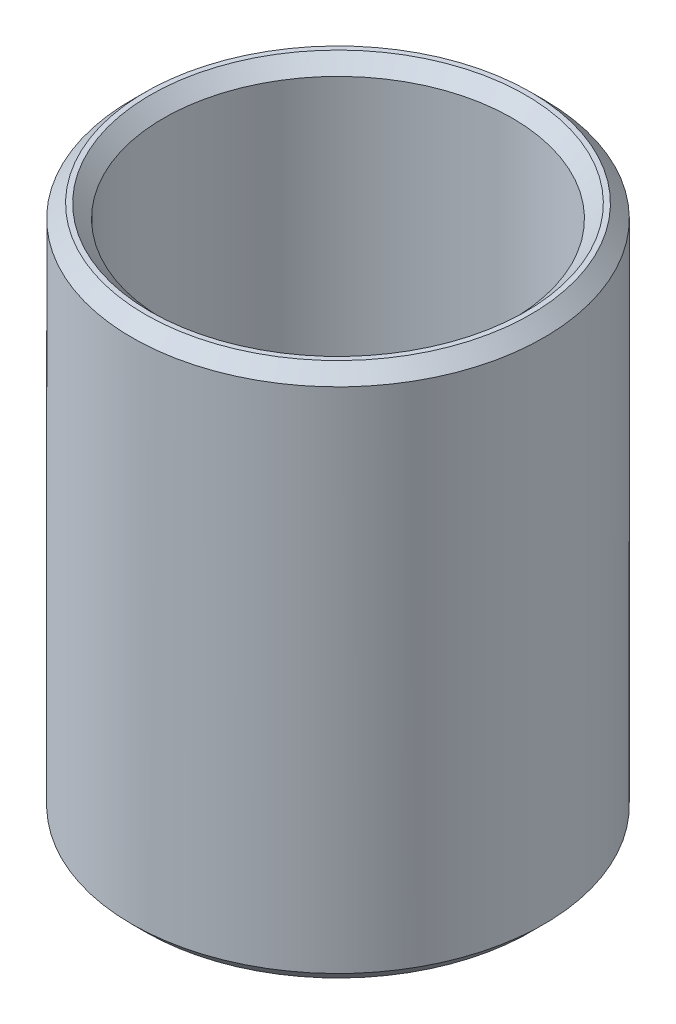
ISO-10303-21;
HEADER;
FILE_DESCRIPTION(('STEP AP214'),'2;1');
FILE_NAME('part.step','',(''),(''),'','','');
FILE_SCHEMA(('AUTOMOTIVE_DESIGN { 1 0 10303 214 1 1 1 1 }'));
ENDSEC;
DATA;
#1=APPLICATION_CONTEXT('core data for automotive mechanical design processes');
#2=APPLICATION_PROTOCOL_DEFINITION('international standard','automotive_design',2000,#1);
#3=PRODUCT_CONTEXT('',#1,'mechanical');
#4=PRODUCT('Part','Part','',(#3));
#5=PRODUCT_RELATED_PRODUCT_CATEGORY('part','',(#4));
#6=PRODUCT_DEFINITION_FORMATION('','',#4);
#7=PRODUCT_DEFINITION_CONTEXT('part definition',#1,'design');
#8=PRODUCT_DEFINITION('design','',#6,#7);
#9=PRODUCT_DEFINITION_SHAPE('','',#8);
#10=(LENGTH_UNIT() NAMED_UNIT(*) SI_UNIT(.MILLI.,.METRE.));
#11=(NAMED_UNIT(*) PLANE_ANGLE_UNIT() SI_UNIT($,.RADIAN.));
#12=(NAMED_UNIT(*) SI_UNIT($,.STERADIAN.) SOLID_ANGLE_UNIT());
#13=UNCERTAINTY_MEASURE_WITH_UNIT(LENGTH_MEASURE(1.E-05),#10,'distance_accuracy_value','');
#14=(GEOMETRIC_REPRESENTATION_CONTEXT(3) GLOBAL_UNCERTAINTY_ASSIGNED_CONTEXT((#13)) GLOBAL_UNIT_ASSIGNED_CONTEXT((#10,
#11,#12)) REPRESENTATION_CONTEXT('',''));
#15=CARTESIAN_POINT('',(0.,0.,0.));
#16=DIRECTION('',(0.,0.,1.));
#17=DIRECTION('',(1.,0.,0.));
#18=AXIS2_PLACEMENT_3D('',#15,#16,#17);
#19=CARTESIAN_POINT('',(0.,155.739882969604,0.));
#20=DIRECTION('',(0.,-1.,0.));
#21=DIRECTION('',(0.,0.,-1.));
#22=AXIS2_PLACEMENT_3D('',#19,#20,#21);
#23=CYLINDRICAL_SURFACE('',#22,60.);
#24=CARTESIAN_POINT('',(0.,3.88763668089645,0.));
#25=DIRECTION('',(0.,1.,0.));
#26=DIRECTION('',(0.,0.,1.));
#27=AXIS2_PLACEMENT_3D('',#24,#25,#26);
#28=CIRCLE('',#27,60.);
#29=CARTESIAN_POINT('',(0.,3.88763668089645,60.));
#30=VERTEX_POINT('',#29);
#31=EDGE_CURVE('E10',#30,#30,#28,.T.);
#32=ORIENTED_EDGE('',*,*,#31,.T.);
#33=EDGE_LOOP('',(#32));
#34=FACE_BOUND('',#33,.T.);
#35=CARTESIAN_POINT('',(0.,151.852246288708,0.));
#36=DIRECTION('',(0.,1.,0.));
#37=DIRECTION('',(0.,0.,1.));
#38=AXIS2_PLACEMENT_3D('',#35,#36,#37);
#39=CIRCLE('',#38,60.);
#40=CARTESIAN_POINT('',(0.,151.852246288708,-60.));
#41=VERTEX_POINT('',#40);
#42=EDGE_CURVE('E50',#41,#41,#39,.F.);
#43=ORIENTED_EDGE('',*,*,#42,.T.);
#44=EDGE_LOOP('',(#43));
#45=FACE_BOUND('',#44,.T.);
#46=ADVANCED_FACE('F39',(#34,#45),#23,.T.);
#47=CARTESIAN_POINT('',(0.,155.739882969604,0.));
#48=DIRECTION('',(0.,1.,0.));
#49=DIRECTION('',(0.,0.,1.));
#50=AXIS2_PLACEMENT_3D('',#47,#48,#49);
#51=PLANE('',#50);
#52=CARTESIAN_POINT('',(0.,155.739882969604,0.));
#53=DIRECTION('',(0.,1.,0.));
#54=DIRECTION('',(0.,0.,1.));
#55=AXIS2_PLACEMENT_3D('',#52,#53,#54);
#56=CIRCLE('',#55,54.6523480973158);
#57=CARTESIAN_POINT('',(0.,155.739882969604,54.6523480973158));
#58=VERTEX_POINT('',#57);
#59=EDGE_CURVE('E58',#58,#58,#56,.F.);
#60=ORIENTED_EDGE('',*,*,#59,.T.);
#61=EDGE_LOOP('',(#60));
#62=FACE_BOUND('',#61,.T.);
#63=CARTESIAN_POINT('',(0.,155.739882969604,0.));
#64=DIRECTION('',(0.,1.,0.));
#65=DIRECTION('',(0.,0.,1.));
#66=AXIS2_PLACEMENT_3D('',#63,#64,#65);
#67=CIRCLE('',#66,56.1123633191036);
#68=CARTESIAN_POINT('',(0.,155.739882969604,-56.1123633191036));
#69=VERTEX_POINT('',#68);
#70=EDGE_CURVE('E61',#69,#69,#67,.T.);
#71=ORIENTED_EDGE('',*,*,#70,.T.);
#72=EDGE_LOOP('',(#71));
#73=FACE_BOUND('',#72,.T.);
#74=ADVANCED_FACE('F88',(#62,#73),#51,.T.);
#75=CARTESIAN_POINT('',(0.,0.,0.));
#76=DIRECTION('',(0.,1.,0.));
#77=DIRECTION('',(0.,0.,1.));
#78=AXIS2_PLACEMENT_3D('',#75,#76,#77);
#79=PLANE('',#78);
#80=CARTESIAN_POINT('',(0.,0.,0.));
#81=DIRECTION('',(0.,1.,0.));
#82=DIRECTION('',(0.,0.,1.));
#83=AXIS2_PLACEMENT_3D('',#80,#81,#82);
#84=CIRCLE('',#83,54.6523480973158);
#85=CARTESIAN_POINT('',(0.,0.,-54.6523480973158));
#86=VERTEX_POINT('',#85);
#87=EDGE_CURVE('E51',#86,#86,#84,.T.);
#88=ORIENTED_EDGE('',*,*,#87,.T.);
#89=EDGE_LOOP('',(#88));
#90=FACE_BOUND('',#89,.T.);
#91=CARTESIAN_POINT('',(0.,0.,0.));
#92=DIRECTION('',(0.,1.,0.));
#93=DIRECTION('',(0.,0.,1.));
#94=AXIS2_PLACEMENT_3D('',#91,#92,#93);
#95=CIRCLE('',#94,56.1123633191035);
#96=CARTESIAN_POINT('',(0.,0.,56.1123633191035));
#97=VERTEX_POINT('',#96);
#98=EDGE_CURVE('E54',#97,#97,#95,.F.);
#99=ORIENTED_EDGE('',*,*,#98,.T.);
#100=EDGE_LOOP('',(#99));
#101=FACE_BOUND('',#100,.T.);
#102=ADVANCED_FACE('F83',(#90,#101),#79,.F.);
#103=CARTESIAN_POINT('',(0.,155.739882969604,0.));
#104=DIRECTION('',(0.,-1.,0.));
#105=DIRECTION('',(0.,0.,-1.));
#106=AXIS2_PLACEMENT_3D('',#103,#104,#105);
#107=CYLINDRICAL_SURFACE('',#106,50.7647114164193);
#108=CARTESIAN_POINT('',(0.,151.852246288708,0.));
#109=DIRECTION('',(0.,1.,0.));
#110=DIRECTION('',(0.,0.,1.));
#111=AXIS2_PLACEMENT_3D('',#108,#109,#110);
#112=CIRCLE('',#111,50.7647114164193);
#113=CARTESIAN_POINT('',(0.,151.852246288708,50.7647114164193));
#114=VERTEX_POINT('',#113);
#115=EDGE_CURVE('E67',#114,#114,#112,.T.);
#116=ORIENTED_EDGE('',*,*,#115,.T.);
#117=EDGE_LOOP('',(#116));
#118=FACE_BOUND('',#117,.T.);
#119=CARTESIAN_POINT('',(0.,3.88763668089651,0.));
#120=DIRECTION('',(0.,1.,0.));
#121=DIRECTION('',(0.,0.,1.));
#122=AXIS2_PLACEMENT_3D('',#119,#120,#121);
#123=CIRCLE('',#122,50.7647114164193);
#124=CARTESIAN_POINT('',(0.,3.88763668089651,-50.7647114164193));
#125=VERTEX_POINT('',#124);
#126=EDGE_CURVE('E69',#125,#125,#123,.F.);
#127=ORIENTED_EDGE('',*,*,#126,.T.);
#128=EDGE_LOOP('',(#127));
#129=FACE_BOUND('',#128,.T.);
#130=ADVANCED_FACE('F71',(#118,#129),#107,.F.);
#131=CARTESIAN_POINT('',(0.,151.852246288708,0.));
#132=DIRECTION('',(0.,1.,0.));
#133=DIRECTION('',(0.,0.,1.));
#134=AXIS2_PLACEMENT_3D('',#131,#132,#133);
#135=CONICAL_SURFACE('',#134,50.7647114164193,0.785398163397447);
#136=ORIENTED_EDGE('',*,*,#59,.F.);
#137=EDGE_LOOP('',(#136));
#138=FACE_BOUND('',#137,.T.);
#139=ORIENTED_EDGE('',*,*,#115,.F.);
#140=EDGE_LOOP('',(#139));
#141=FACE_BOUND('',#140,.T.);
#142=ADVANCED_FACE('F77',(#138,#141),#135,.F.);
#143=CARTESIAN_POINT('',(0.,0.,0.));
#144=DIRECTION('',(0.,-1.,0.));
#145=DIRECTION('',(0.,0.,-1.));
#146=AXIS2_PLACEMENT_3D('',#143,#144,#145);
#147=CONICAL_SURFACE('',#146,54.6523480973158,0.785398163397443);
#148=CARTESIAN_POINT('',(0.,3.88763668089651,-50.7647114164193));
#149=CARTESIAN_POINT('',(0.,3.8471404654705,-50.8052076318453));
#150=CARTESIAN_POINT('',(0.,3.8066442500445,-50.8457038472713));
#151=CARTESIAN_POINT('',(0.,3.72565181919248,-50.9266962781233));
#152=CARTESIAN_POINT('',(0.,3.68515560376648,-50.9671924935493));
#153=CARTESIAN_POINT('',(0.,3.60416317291447,-51.0481849244013));
#154=CARTESIAN_POINT('',(0.,3.56366695748846,-51.0886811398273));
#155=CARTESIAN_POINT('',(0.,3.48267452663645,-51.1696735706793));
#156=CARTESIAN_POINT('',(0.,3.44217831121045,-51.2101697861053));
#157=CARTESIAN_POINT('',(0.,3.36118588035844,-51.2911622169574));
#158=CARTESIAN_POINT('',(0.,3.32068966493243,-51.3316584323834));
#159=CARTESIAN_POINT('',(0.,3.23969723408042,-51.4126508632354));
#160=CARTESIAN_POINT('',(0.,3.19920101865442,-51.4531470786614));
#161=CARTESIAN_POINT('',(0.,3.11820858780241,-51.5341395095134));
#162=CARTESIAN_POINT('',(0.,3.0777123723764,-51.5746357249394));
#163=CARTESIAN_POINT('',(0.,2.99671994152439,-51.6556281557914));
#164=CARTESIAN_POINT('',(0.,2.95622372609838,-51.6961243712174));
#165=CARTESIAN_POINT('',(0.,2.87523129524637,-51.7771168020694));
#166=CARTESIAN_POINT('',(0.,2.83473507982037,-51.8176130174954));
#167=CARTESIAN_POINT('',(0.,2.75374264896836,-51.8986054483474));
#168=CARTESIAN_POINT('',(0.,2.71324643354235,-51.9391016637734));
#169=CARTESIAN_POINT('',(0.,2.63225400269034,-52.0200940946254));
#170=CARTESIAN_POINT('',(0.,2.59175778726434,-52.0605903100514));
#171=CARTESIAN_POINT('',(0.,2.51076535641233,-52.1415827409035));
#172=CARTESIAN_POINT('',(0.,2.47026914098632,-52.1820789563295));
#173=CARTESIAN_POINT('',(0.,2.38927671013431,-52.2630713871815));
#174=CARTESIAN_POINT('',(0.,2.34878049470831,-52.3035676026075));
#175=CARTESIAN_POINT('',(0.,2.2677880638563,-52.3845600334595));
#176=CARTESIAN_POINT('',(0.,2.22729184843029,-52.4250562488855));
#177=CARTESIAN_POINT('',(0.,2.14629941757828,-52.5060486797375));
#178=CARTESIAN_POINT('',(0.,2.10580320215227,-52.5465448951635));
#179=CARTESIAN_POINT('',(0.,2.02481077130026,-52.6275373260155));
#180=CARTESIAN_POINT('',(0.,1.98431455587426,-52.6680335414415));
#181=CARTESIAN_POINT('',(0.,1.90332212502225,-52.7490259722935));
#182=CARTESIAN_POINT('',(0.,1.86282590959624,-52.7895221877195));
#183=CARTESIAN_POINT('',(0.,1.78183347874423,-52.8705146185715));
#184=CARTESIAN_POINT('',(0.,1.74133726331823,-52.9110108339975));
#185=CARTESIAN_POINT('',(0.,1.66034483246622,-52.9920032648496));
#186=CARTESIAN_POINT('',(0.,1.61984861704021,-53.0324994802756));
#187=CARTESIAN_POINT('',(0.,1.5388561861882,-53.1134919111276));
#188=CARTESIAN_POINT('',(0.,1.49835997076219,-53.1539881265536));
#189=CARTESIAN_POINT('',(0.,1.41736753991018,-53.2349805574056));
#190=CARTESIAN_POINT('',(0.,1.37687132448418,-53.2754767728316));
#191=CARTESIAN_POINT('',(0.,1.29587889363217,-53.3564692036836));
#192=CARTESIAN_POINT('',(0.,1.25538267820616,-53.3969654191096));
#193=CARTESIAN_POINT('',(0.,1.17439024735415,-53.4779578499616));
#194=CARTESIAN_POINT('',(0.,1.13389403192815,-53.5184540653876));
#195=CARTESIAN_POINT('',(0.,1.05290160107614,-53.5994464962396));
#196=CARTESIAN_POINT('',(0.,1.01240538565013,-53.6399427116656));
#197=CARTESIAN_POINT('',(0.,0.931412954798122,-53.7209351425176));
#198=CARTESIAN_POINT('',(0.,0.890916739372116,-53.7614313579436));
#199=CARTESIAN_POINT('',(0.,0.809924308520105,-53.8424237887957));
#200=CARTESIAN_POINT('',(0.,0.7694280930941,-53.8829200042217));
#201=CARTESIAN_POINT('',(0.,0.688435662242089,-53.9639124350737));
#202=CARTESIAN_POINT('',(0.,0.647939446816084,-54.0044086504997));
#203=CARTESIAN_POINT('',(0.,0.566947015964074,-54.0854010813517));
#204=CARTESIAN_POINT('',(0.,0.526450800538069,-54.1258972967777));
#205=CARTESIAN_POINT('',(0.,0.445458369686058,-54.2068897276297));
#206=CARTESIAN_POINT('',(0.,0.404962154260052,-54.2473859430557));
#207=CARTESIAN_POINT('',(0.,0.323969723408042,-54.3283783739077));
#208=CARTESIAN_POINT('',(0.,0.283473507982037,-54.3688745893337));
#209=CARTESIAN_POINT('',(0.,0.202481077130027,-54.4498670201857));
#210=CARTESIAN_POINT('',(0.,0.161984861704021,-54.4903632356117));
#211=CARTESIAN_POINT('',(0.,0.0809924308520102,-54.5713556664637));
#212=CARTESIAN_POINT('',(0.,0.0404962154260046,-54.6118518818897));
#213=CARTESIAN_POINT('',(0.,0.,-54.6523480973158));
#214=B_SPLINE_CURVE_WITH_KNOTS('',3,(#148,#149,#150,#151,#152,#153,#154,#155,#156,#157,#158,
#159,#160,#161,#162,#163,#164,#165,#166,#167,#168,#169,#170,#171,#172,#173,#174,#175,#176,#177,
#178,#179,#180,#181,#182,#183,#184,#185,#186,#187,#188,#189,#190,#191,#192,#193,#194,#195,#196,
#197,#198,#199,#200,#201,#202,#203,#204,#205,#206,#207,#208,#209,#210,#211,#212,#213),
.UNSPECIFIED.,.F.,.F.,(4,2,2,2,2,2,2,2,2,2,2,2,2,2,2,2,2,2,2,2,2,2,2,2,2,2,2,2,2,2,2,2,4),(0.,
0.171810891240716,0.343621782481431,0.515432673722152,0.687243564962868,0.859054456203584,
1.0308653474443,1.20267623868502,1.37448712992574,1.54629802116645,1.71810891240717,
1.88991980364788,2.0617306948886,2.23354158612932,2.40535247737003,2.57716336861075,
2.74897425985147,2.92078515109218,3.0925960423329,3.26440693357362,3.43621782481433,
3.60802871605505,3.77983960729577,3.95165049853648,4.1234613897772,4.29527228101792,
4.46708317225863,4.63889406349935,4.81070495474006,4.98251584598078,5.1543267372215,
5.32613762846222,5.49794851970293),.UNSPECIFIED.);
#215=EDGE_CURVE('BSEAM73',#125,#86,#214,.T.);
#216=ORIENTED_EDGE('',*,*,#126,.F.);
#217=ORIENTED_EDGE('',*,*,#87,.F.);
#218=ORIENTED_EDGE('',*,*,#215,.T.);
#219=ORIENTED_EDGE('',*,*,#215,.F.);
#220=EDGE_LOOP('',(#216,#218,#217,#219));
#221=FACE_BOUND('',#220,.T.);
#222=ADVANCED_FACE('F73',(#221),#147,.F.);
#223=CARTESIAN_POINT('',(0.,3.88763668089645,0.));
#224=DIRECTION('',(0.,1.,0.));
#225=DIRECTION('',(0.,0.,1.));
#226=AXIS2_PLACEMENT_3D('',#223,#224,#225);
#227=CONICAL_SURFACE('',#226,60.,0.78539816339745);
#228=ORIENTED_EDGE('',*,*,#98,.F.);
#229=EDGE_LOOP('',(#228));
#230=FACE_BOUND('',#229,.T.);
#231=ORIENTED_EDGE('',*,*,#31,.F.);
#232=EDGE_LOOP('',(#231));
#233=FACE_BOUND('',#232,.T.);
#234=ADVANCED_FACE('F76',(#230,#233),#227,.T.);
#235=CARTESIAN_POINT('',(0.,155.739882969604,0.));
#236=DIRECTION('',(0.,-1.,0.));
#237=DIRECTION('',(0.,0.,-1.));
#238=AXIS2_PLACEMENT_3D('',#235,#236,#237);
#239=CONICAL_SURFACE('',#238,56.1123633191036,0.785398163397441);
#240=CARTESIAN_POINT('',(0.,151.852246288708,-60.));
#241=CARTESIAN_POINT('',(0.,151.892742504134,-59.959503784574));
#242=CARTESIAN_POINT('',(0.,151.93323871956,-59.919007569148));
#243=CARTESIAN_POINT('',(0.,152.014231150412,-59.838015138296));
#244=CARTESIAN_POINT('',(0.,152.054727365838,-59.79751892287));
#245=CARTESIAN_POINT('',(0.,152.13571979669,-59.716526492018));
#246=CARTESIAN_POINT('',(0.,152.176216012116,-59.676030276592));
#247=CARTESIAN_POINT('',(0.,152.257208442968,-59.59503784574));
#248=CARTESIAN_POINT('',(0.,152.297704658394,-59.554541630314));
#249=CARTESIAN_POINT('',(0.,152.378697089246,-59.473549199462));
#250=CARTESIAN_POINT('',(0.,152.419193304672,-59.4330529840359));
#251=CARTESIAN_POINT('',(0.,152.500185735524,-59.3520605531839));
#252=CARTESIAN_POINT('',(0.,152.54068195095,-59.3115643377579));
#253=CARTESIAN_POINT('',(0.,152.621674381802,-59.2305719069059));
#254=CARTESIAN_POINT('',(0.,152.662170597228,-59.1900756914799));
#255=CARTESIAN_POINT('',(0.,152.74316302808,-59.1090832606279));
#256=CARTESIAN_POINT('',(0.,152.783659243506,-59.0685870452019));
#257=CARTESIAN_POINT('',(0.,152.864651674358,-58.9875946143499));
#258=CARTESIAN_POINT('',(0.,152.905147889784,-58.9470983989239));
#259=CARTESIAN_POINT('',(0.,152.986140320636,-58.8661059680719));
#260=CARTESIAN_POINT('',(0.,153.026636536062,-58.8256097526459));
#261=CARTESIAN_POINT('',(0.,153.107628966914,-58.7446173217939));
#262=CARTESIAN_POINT('',(0.,153.14812518234,-58.7041211063679));
#263=CARTESIAN_POINT('',(0.,153.229117613192,-58.6231286755159));
#264=CARTESIAN_POINT('',(0.,153.269613828618,-58.5826324600898));
#265=CARTESIAN_POINT('',(0.,153.35060625947,-58.5016400292378));
#266=CARTESIAN_POINT('',(0.,153.391102474896,-58.4611438138118));
#267=CARTESIAN_POINT('',(0.,153.472094905748,-58.3801513829598));
#268=CARTESIAN_POINT('',(0.,153.512591121174,-58.3396551675338));
#269=CARTESIAN_POINT('',(0.,153.593583552026,-58.2586627366818));
#270=CARTESIAN_POINT('',(0.,153.634079767452,-58.2181665212558));
#271=CARTESIAN_POINT('',(0.,153.715072198304,-58.1371740904038));
#272=CARTESIAN_POINT('',(0.,153.75556841373,-58.0966778749778));
#273=CARTESIAN_POINT('',(0.,153.836560844582,-58.0156854441258));
#274=CARTESIAN_POINT('',(0.,153.877057060008,-57.9751892286998));
#275=CARTESIAN_POINT('',(0.,153.95804949086,-57.8941967978478));
#276=CARTESIAN_POINT('',(0.,153.998545706286,-57.8537005824218));
#277=CARTESIAN_POINT('',(0.,154.079538137138,-57.7727081515698));
#278=CARTESIAN_POINT('',(0.,154.120034352564,-57.7322119361437));
#279=CARTESIAN_POINT('',(0.,154.201026783416,-57.6512195052917));
#280=CARTESIAN_POINT('',(0.,154.241522998842,-57.6107232898657));
#281=CARTESIAN_POINT('',(0.,154.322515429694,-57.5297308590137));
#282=CARTESIAN_POINT('',(0.,154.36301164512,-57.4892346435877));
#283=CARTESIAN_POINT('',(0.,154.444004075972,-57.4082422127357));
#284=CARTESIAN_POINT('',(0.,154.484500291398,-57.3677459973097));
#285=CARTESIAN_POINT('',(0.,154.56549272225,-57.2867535664577));
#286=CARTESIAN_POINT('',(0.,154.605988937676,-57.2462573510317));
#287=CARTESIAN_POINT('',(0.,154.686981368528,-57.1652649201797));
#288=CARTESIAN_POINT('',(0.,154.727477583954,-57.1247687047537));
#289=CARTESIAN_POINT('',(0.,154.808470014806,-57.0437762739017));
#290=CARTESIAN_POINT('',(0.,154.848966230232,-57.0032800584757));
#291=CARTESIAN_POINT('',(0.,154.929958661084,-56.9222876276237));
#292=CARTESIAN_POINT('',(0.,154.97045487651,-56.8817914121977));
#293=CARTESIAN_POINT('',(0.,155.051447307362,-56.8007989813456));
#294=CARTESIAN_POINT('',(0.,155.091943522788,-56.7603027659196));
#295=CARTESIAN_POINT('',(0.,155.17293595364,-56.6793103350676));
#296=CARTESIAN_POINT('',(0.,155.213432169066,-56.6388141196416));
#297=CARTESIAN_POINT('',(0.,155.294424599918,-56.5578216887896));
#298=CARTESIAN_POINT('',(0.,155.334920815344,-56.5173254733636));
#299=CARTESIAN_POINT('',(0.,155.415913246196,-56.4363330425116));
#300=CARTESIAN_POINT('',(0.,155.456409461622,-56.3958368270856));
#301=CARTESIAN_POINT('',(0.,155.537401892474,-56.3148443962336));
#302=CARTESIAN_POINT('',(0.,155.5778981079,-56.2743481808076));
#303=CARTESIAN_POINT('',(0.,155.658890538752,-56.1933557499556));
#304=CARTESIAN_POINT('',(0.,155.699386754178,-56.1528595345296));
#305=CARTESIAN_POINT('',(0.,155.739882969604,-56.1123633191036));
#306=B_SPLINE_CURVE_WITH_KNOTS('',3,(#240,#241,#242,#243,#244,#245,#246,#247,#248,#249,#250,
#251,#252,#253,#254,#255,#256,#257,#258,#259,#260,#261,#262,#263,#264,#265,#266,#267,#268,#269,
#270,#271,#272,#273,#274,#275,#276,#277,#278,#279,#280,#281,#282,#283,#284,#285,#286,#287,#288,
#289,#290,#291,#292,#293,#294,#295,#296,#297,#298,#299,#300,#301,#302,#303,#304,#305),
.UNSPECIFIED.,.F.,.F.,(4,2,2,2,2,2,2,2,2,2,2,2,2,2,2,2,2,2,2,2,2,2,2,2,2,2,2,2,2,2,2,2,4),(0.,
0.171810891240729,0.343621782481438,0.515432673722166,0.687243564962875,0.859054456203589,
1.03086534744432,1.20267623868503,1.37448712992574,1.54629802116646,1.71810891240717,
1.88991980364788,2.06173069488861,2.23354158612932,2.40535247737003,2.57716336861076,
2.74897425985147,2.92078515109218,3.09259604233291,3.26440693357362,3.43621782481433,
3.60802871605506,3.77983960729577,3.95165049853648,4.12346138977721,4.29527228101792,
4.46708317225862,4.63889406349935,4.81070495474007,4.98251584598078,5.15432673722151,
5.32613762846221,5.49794851970294),.UNSPECIFIED.);
#307=EDGE_CURVE('BSEAM45',#41,#69,#306,.T.);
#308=ORIENTED_EDGE('',*,*,#42,.F.);
#309=ORIENTED_EDGE('',*,*,#70,.F.);
#310=ORIENTED_EDGE('',*,*,#307,.T.);
#311=ORIENTED_EDGE('',*,*,#307,.F.);
#312=EDGE_LOOP('',(#308,#310,#309,#311));
#313=FACE_BOUND('',#312,.T.);
#314=ADVANCED_FACE('F45',(#313),#239,.T.);
#315=CLOSED_SHELL('',(#46,#74,#102,#130,#142,#222,#234,#314));
#316=MANIFOLD_SOLID_BREP('B2',#315);
#317=ADVANCED_BREP_SHAPE_REPRESENTATION('',(#18,#316),#14);
#318=SHAPE_DEFINITION_REPRESENTATION(#9,#317);
ENDSEC;
END-ISO-10303-21;
